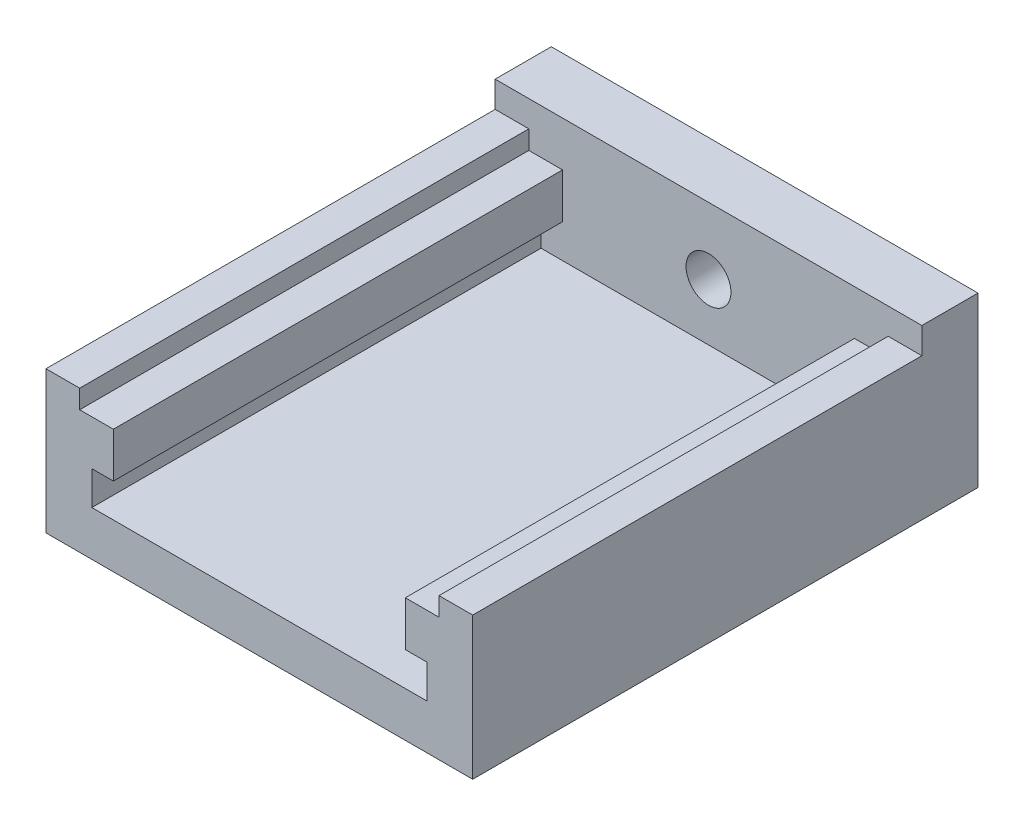
ISO-10303-21;
HEADER;
FILE_DESCRIPTION(('STEP AP214'),'2;1');
FILE_NAME('part.step','',(''),(''),'','','');
FILE_SCHEMA(('AUTOMOTIVE_DESIGN { 1 0 10303 214 1 1 1 1 }'));
ENDSEC;
DATA;
#1=APPLICATION_CONTEXT('core data for automotive mechanical design processes');
#2=APPLICATION_PROTOCOL_DEFINITION('international standard','automotive_design',2000,#1);
#3=PRODUCT_CONTEXT('',#1,'mechanical');
#4=PRODUCT('Part','Part','',(#3));
#5=PRODUCT_RELATED_PRODUCT_CATEGORY('part','',(#4));
#6=PRODUCT_DEFINITION_FORMATION('','',#4);
#7=PRODUCT_DEFINITION_CONTEXT('part definition',#1,'design');
#8=PRODUCT_DEFINITION('design','',#6,#7);
#9=PRODUCT_DEFINITION_SHAPE('','',#8);
#10=(LENGTH_UNIT() NAMED_UNIT(*) SI_UNIT(.MILLI.,.METRE.));
#11=(NAMED_UNIT(*) PLANE_ANGLE_UNIT() SI_UNIT($,.RADIAN.));
#12=(NAMED_UNIT(*) SI_UNIT($,.STERADIAN.) SOLID_ANGLE_UNIT());
#13=UNCERTAINTY_MEASURE_WITH_UNIT(LENGTH_MEASURE(1.E-05),#10,'distance_accuracy_value','');
#14=(GEOMETRIC_REPRESENTATION_CONTEXT(3) GLOBAL_UNCERTAINTY_ASSIGNED_CONTEXT((#13)) GLOBAL_UNIT_ASSIGNED_CONTEXT((#10,
#11,#12)) REPRESENTATION_CONTEXT('',''));
#15=CARTESIAN_POINT('',(0.,0.,0.));
#16=DIRECTION('',(0.,0.,1.));
#17=DIRECTION('',(1.,0.,0.));
#18=AXIS2_PLACEMENT_3D('',#15,#16,#17);
#19=CARTESIAN_POINT('',(-16.,3.60917959288161,40.));
#20=DIRECTION('',(-1.,0.,0.));
#21=DIRECTION('',(0.,0.,1.));
#22=AXIS2_PLACEMENT_3D('',#19,#20,#21);
#23=PLANE('',#22);
#24=DIRECTION('',(0.,1.,0.));
#25=VECTOR('',#24,1.);
#26=CARTESIAN_POINT('',(-16.,3.60917959288161,0.));
#27=LINE('',#26,#25);
#28=CARTESIAN_POINT('',(-16.,1.94251292621495,0.));
#29=VERTEX_POINT('',#28);
#30=CARTESIAN_POINT('',(-16.,3.60917959288161,0.));
#31=VERTEX_POINT('',#30);
#32=EDGE_CURVE('E200',#29,#31,#27,.T.);
#33=ORIENTED_EDGE('',*,*,#32,.T.);
#34=DIRECTION('',(0.,0.,-1.));
#35=VECTOR('',#34,1.);
#36=CARTESIAN_POINT('',(-16.,3.60917959288161,40.));
#37=LINE('',#36,#35);
#38=CARTESIAN_POINT('',(-16.,3.60917959288161,40.));
#39=VERTEX_POINT('',#38);
#40=EDGE_CURVE('E11',#39,#31,#37,.T.);
#41=ORIENTED_EDGE('',*,*,#40,.F.);
#42=DIRECTION('',(0.,1.,0.));
#43=VECTOR('',#42,1.);
#44=CARTESIAN_POINT('',(-16.,3.60917959288161,40.));
#45=LINE('',#44,#43);
#46=CARTESIAN_POINT('',(-16.,1.94251292621495,40.));
#47=VERTEX_POINT('',#46);
#48=EDGE_CURVE('E201',#47,#39,#45,.T.);
#49=ORIENTED_EDGE('',*,*,#48,.F.);
#50=DIRECTION('',(0.,0.,-1.));
#51=VECTOR('',#50,1.);
#52=CARTESIAN_POINT('',(-16.,1.94251292621495,40.));
#53=LINE('',#52,#51);
#54=EDGE_CURVE('E232',#47,#29,#53,.T.);
#55=ORIENTED_EDGE('',*,*,#54,.T.);
#56=EDGE_LOOP('',(#33,#41,#49,#55));
#57=FACE_BOUND('',#56,.T.);
#58=ADVANCED_FACE('F33',(#57),#23,.F.);
#59=CARTESIAN_POINT('',(-19.,3.60917959288161,40.));
#60=DIRECTION('',(0.,-1.,0.));
#61=DIRECTION('',(1.,0.,0.));
#62=AXIS2_PLACEMENT_3D('',#59,#60,#61);
#63=PLANE('',#62);
#64=DIRECTION('',(-1.,0.,0.));
#65=VECTOR('',#64,1.);
#66=CARTESIAN_POINT('',(-19.,3.60917959288161,0.));
#67=LINE('',#66,#65);
#68=CARTESIAN_POINT('',(-19.,3.60917959288161,0.));
#69=VERTEX_POINT('',#68);
#70=EDGE_CURVE('E235',#31,#69,#67,.T.);
#71=ORIENTED_EDGE('',*,*,#70,.T.);
#72=DIRECTION('',(0.,0.,-1.));
#73=VECTOR('',#72,1.);
#74=CARTESIAN_POINT('',(-19.,3.60917959288161,40.));
#75=LINE('',#74,#73);
#76=CARTESIAN_POINT('',(-19.,3.60917959288161,40.));
#77=VERTEX_POINT('',#76);
#78=EDGE_CURVE('E41',#77,#69,#75,.T.);
#79=ORIENTED_EDGE('',*,*,#78,.F.);
#80=DIRECTION('',(-1.,0.,0.));
#81=VECTOR('',#80,1.);
#82=CARTESIAN_POINT('',(-19.,3.60917959288161,40.));
#83=LINE('',#82,#81);
#84=EDGE_CURVE('E203',#39,#77,#83,.T.);
#85=ORIENTED_EDGE('',*,*,#84,.F.);
#86=ORIENTED_EDGE('',*,*,#40,.T.);
#87=EDGE_LOOP('',(#71,#79,#85,#86));
#88=FACE_BOUND('',#87,.T.);
#89=ADVANCED_FACE('F312',(#88),#63,.F.);
#90=CARTESIAN_POINT('',(-19.,-9.05748707378505,40.));
#91=DIRECTION('',(1.,0.,0.));
#92=DIRECTION('',(0.,1.,0.));
#93=AXIS2_PLACEMENT_3D('',#90,#91,#92);
#94=PLANE('',#93);
#95=ORIENTED_EDGE('',*,*,#78,.T.);
#96=DIRECTION('',(0.,1.,0.));
#97=VECTOR('',#96,1.);
#98=CARTESIAN_POINT('',(-19.,-9.05748707378505,0.));
#99=LINE('',#98,#97);
#100=CARTESIAN_POINT('',(-19.,5.94251292621495,0.));
#101=VERTEX_POINT('',#100);
#102=EDGE_CURVE('E182',#69,#101,#99,.T.);
#103=ORIENTED_EDGE('',*,*,#102,.T.);
#104=DIRECTION('',(0.,0.,1.));
#105=VECTOR('',#104,1.);
#106=CARTESIAN_POINT('',(-19.,5.94251292621495,-5.));
#107=LINE('',#106,#105);
#108=CARTESIAN_POINT('',(-19.,5.94251292621495,-5.));
#109=VERTEX_POINT('',#108);
#110=EDGE_CURVE('E197',#109,#101,#107,.T.);
#111=ORIENTED_EDGE('',*,*,#110,.F.);
#112=DIRECTION('',(0.,1.,0.));
#113=VECTOR('',#112,1.);
#114=CARTESIAN_POINT('',(-19.,-9.05748707378505,-5.));
#115=LINE('',#114,#113);
#116=CARTESIAN_POINT('',(-19.,-9.05748707378505,-5.));
#117=VERTEX_POINT('',#116);
#118=EDGE_CURVE('E173',#117,#109,#115,.T.);
#119=ORIENTED_EDGE('',*,*,#118,.F.);
#120=DIRECTION('',(0.,0.,-1.));
#121=VECTOR('',#120,1.);
#122=CARTESIAN_POINT('',(-19.,-9.05748707378505,40.));
#123=LINE('',#122,#121);
#124=CARTESIAN_POINT('',(-19.,-9.05748707378505,40.));
#125=VERTEX_POINT('',#124);
#126=EDGE_CURVE('E164',#125,#117,#123,.T.);
#127=ORIENTED_EDGE('',*,*,#126,.F.);
#128=DIRECTION('',(0.,-1.,0.));
#129=VECTOR('',#128,1.);
#130=CARTESIAN_POINT('',(-19.,-9.05748707378505,40.));
#131=LINE('',#130,#129);
#132=EDGE_CURVE('E206',#77,#125,#131,.T.);
#133=ORIENTED_EDGE('',*,*,#132,.F.);
#134=EDGE_LOOP('',(#95,#103,#111,#119,#127,#133));
#135=FACE_BOUND('',#134,.T.);
#136=ADVANCED_FACE('F308',(#135),#94,.F.);
#137=CARTESIAN_POINT('',(19.,-9.05748707378505,40.));
#138=DIRECTION('',(0.,1.,0.));
#139=DIRECTION('',(0.,0.,1.));
#140=AXIS2_PLACEMENT_3D('',#137,#138,#139);
#141=PLANE('',#140);
#142=ORIENTED_EDGE('',*,*,#126,.T.);
#143=DIRECTION('',(-1.,0.,0.));
#144=VECTOR('',#143,1.);
#145=CARTESIAN_POINT('',(19.,-9.05748707378505,-5.));
#146=LINE('',#145,#144);
#147=CARTESIAN_POINT('',(19.,-9.05748707378505,-5.));
#148=VERTEX_POINT('',#147);
#149=EDGE_CURVE('E168',#148,#117,#146,.T.);
#150=ORIENTED_EDGE('',*,*,#149,.F.);
#151=DIRECTION('',(0.,0.,-1.));
#152=VECTOR('',#151,1.);
#153=CARTESIAN_POINT('',(19.,-9.05748707378505,40.));
#154=LINE('',#153,#152);
#155=CARTESIAN_POINT('',(19.,-9.05748707378505,40.));
#156=VERTEX_POINT('',#155);
#157=EDGE_CURVE('E154',#156,#148,#154,.T.);
#158=ORIENTED_EDGE('',*,*,#157,.F.);
#159=DIRECTION('',(1.,0.,0.));
#160=VECTOR('',#159,1.);
#161=CARTESIAN_POINT('',(19.,-9.05748707378505,40.));
#162=LINE('',#161,#160);
#163=EDGE_CURVE('E208',#125,#156,#162,.T.);
#164=ORIENTED_EDGE('',*,*,#163,.F.);
#165=EDGE_LOOP('',(#142,#150,#158,#164));
#166=FACE_BOUND('',#165,.T.);
#167=ADVANCED_FACE('F169',(#166),#141,.F.);
#168=CARTESIAN_POINT('',(19.,-9.05748707378505,40.));
#169=DIRECTION('',(-1.,0.,0.));
#170=DIRECTION('',(0.,-1.,0.));
#171=AXIS2_PLACEMENT_3D('',#168,#169,#170);
#172=PLANE('',#171);
#173=ORIENTED_EDGE('',*,*,#157,.T.);
#174=DIRECTION('',(0.,-1.,0.));
#175=VECTOR('',#174,1.);
#176=CARTESIAN_POINT('',(19.,-9.05748707378505,-5.));
#177=LINE('',#176,#175);
#178=CARTESIAN_POINT('',(19.,5.94251292621495,-5.));
#179=VERTEX_POINT('',#178);
#180=EDGE_CURVE('E159',#179,#148,#177,.T.);
#181=ORIENTED_EDGE('',*,*,#180,.F.);
#182=DIRECTION('',(0.,0.,1.));
#183=VECTOR('',#182,1.);
#184=CARTESIAN_POINT('',(19.,5.94251292621495,-5.));
#185=LINE('',#184,#183);
#186=CARTESIAN_POINT('',(19.,5.94251292621495,0.));
#187=VERTEX_POINT('',#186);
#188=EDGE_CURVE('E190',#179,#187,#185,.T.);
#189=ORIENTED_EDGE('',*,*,#188,.T.);
#190=DIRECTION('',(0.,-1.,0.));
#191=VECTOR('',#190,1.);
#192=CARTESIAN_POINT('',(19.,-9.05748707378505,0.));
#193=LINE('',#192,#191);
#194=CARTESIAN_POINT('',(19.,3.60917959288161,0.));
#195=VERTEX_POINT('',#194);
#196=EDGE_CURVE('E191',#187,#195,#193,.T.);
#197=ORIENTED_EDGE('',*,*,#196,.T.);
#198=DIRECTION('',(0.,0.,-1.));
#199=VECTOR('',#198,1.);
#200=CARTESIAN_POINT('',(19.,3.60917959288161,40.));
#201=LINE('',#200,#199);
#202=CARTESIAN_POINT('',(19.,3.60917959288161,40.));
#203=VERTEX_POINT('',#202);
#204=EDGE_CURVE('E165',#203,#195,#201,.T.);
#205=ORIENTED_EDGE('',*,*,#204,.F.);
#206=DIRECTION('',(0.,1.,0.));
#207=VECTOR('',#206,1.);
#208=CARTESIAN_POINT('',(19.,-9.05748707378505,40.));
#209=LINE('',#208,#207);
#210=EDGE_CURVE('E161',#156,#203,#209,.T.);
#211=ORIENTED_EDGE('',*,*,#210,.F.);
#212=EDGE_LOOP('',(#173,#181,#189,#197,#205,#211));
#213=FACE_BOUND('',#212,.T.);
#214=ADVANCED_FACE('F156',(#213),#172,.F.);
#215=CARTESIAN_POINT('',(19.,3.60917959288161,40.));
#216=DIRECTION('',(0.,-1.,0.));
#217=DIRECTION('',(1.,0.,0.));
#218=AXIS2_PLACEMENT_3D('',#215,#216,#217);
#219=PLANE('',#218);
#220=DIRECTION('',(-1.,0.,0.));
#221=VECTOR('',#220,1.);
#222=CARTESIAN_POINT('',(19.,3.60917959288161,0.));
#223=LINE('',#222,#221);
#224=CARTESIAN_POINT('',(16.,3.60917959288161,0.));
#225=VERTEX_POINT('',#224);
#226=EDGE_CURVE('E238',#195,#225,#223,.T.);
#227=ORIENTED_EDGE('',*,*,#226,.T.);
#228=DIRECTION('',(0.,0.,-1.));
#229=VECTOR('',#228,1.);
#230=CARTESIAN_POINT('',(16.,3.60917959288161,40.));
#231=LINE('',#230,#229);
#232=CARTESIAN_POINT('',(16.,3.60917959288161,40.));
#233=VERTEX_POINT('',#232);
#234=EDGE_CURVE('E299',#233,#225,#231,.T.);
#235=ORIENTED_EDGE('',*,*,#234,.F.);
#236=DIRECTION('',(-1.,0.,0.));
#237=VECTOR('',#236,1.);
#238=CARTESIAN_POINT('',(19.,3.60917959288161,40.));
#239=LINE('',#238,#237);
#240=EDGE_CURVE('E211',#203,#233,#239,.T.);
#241=ORIENTED_EDGE('',*,*,#240,.F.);
#242=ORIENTED_EDGE('',*,*,#204,.T.);
#243=EDGE_LOOP('',(#227,#235,#241,#242));
#244=FACE_BOUND('',#243,.T.);
#245=ADVANCED_FACE('F322',(#244),#219,.F.);
#246=CARTESIAN_POINT('',(16.,3.60917959288161,40.));
#247=DIRECTION('',(1.,0.,0.));
#248=DIRECTION('',(0.,0.,-1.));
#249=AXIS2_PLACEMENT_3D('',#246,#247,#248);
#250=PLANE('',#249);
#251=DIRECTION('',(0.,-1.,0.));
#252=VECTOR('',#251,1.);
#253=CARTESIAN_POINT('',(16.,3.60917959288161,0.));
#254=LINE('',#253,#252);
#255=CARTESIAN_POINT('',(16.,1.94251292621495,0.));
#256=VERTEX_POINT('',#255);
#257=EDGE_CURVE('E241',#225,#256,#254,.T.);
#258=ORIENTED_EDGE('',*,*,#257,.T.);
#259=DIRECTION('',(0.,0.,-1.));
#260=VECTOR('',#259,1.);
#261=CARTESIAN_POINT('',(16.,1.94251292621495,40.));
#262=LINE('',#261,#260);
#263=CARTESIAN_POINT('',(16.,1.94251292621495,40.));
#264=VERTEX_POINT('',#263);
#265=EDGE_CURVE('E296',#264,#256,#262,.T.);
#266=ORIENTED_EDGE('',*,*,#265,.F.);
#267=DIRECTION('',(0.,-1.,0.));
#268=VECTOR('',#267,1.);
#269=CARTESIAN_POINT('',(16.,3.60917959288161,40.));
#270=LINE('',#269,#268);
#271=EDGE_CURVE('E213',#233,#264,#270,.T.);
#272=ORIENTED_EDGE('',*,*,#271,.F.);
#273=ORIENTED_EDGE('',*,*,#234,.T.);
#274=EDGE_LOOP('',(#258,#266,#272,#273));
#275=FACE_BOUND('',#274,.T.);
#276=ADVANCED_FACE('F364',(#275),#250,.F.);
#277=CARTESIAN_POINT('',(16.,1.94251292621495,40.));
#278=DIRECTION('',(0.,-1.,0.));
#279=DIRECTION('',(0.,0.,-1.));
#280=AXIS2_PLACEMENT_3D('',#277,#278,#279);
#281=PLANE('',#280);
#282=DIRECTION('',(-1.,0.,0.));
#283=VECTOR('',#282,1.);
#284=CARTESIAN_POINT('',(16.,1.94251292621495,0.));
#285=LINE('',#284,#283);
#286=CARTESIAN_POINT('',(13.,1.94251292621495,0.));
#287=VERTEX_POINT('',#286);
#288=EDGE_CURVE('E244',#256,#287,#285,.T.);
#289=ORIENTED_EDGE('',*,*,#288,.T.);
#290=DIRECTION('',(0.,0.,-1.));
#291=VECTOR('',#290,1.);
#292=CARTESIAN_POINT('',(13.,1.94251292621495,40.));
#293=LINE('',#292,#291);
#294=CARTESIAN_POINT('',(13.,1.94251292621495,40.));
#295=VERTEX_POINT('',#294);
#296=EDGE_CURVE('E293',#295,#287,#293,.T.);
#297=ORIENTED_EDGE('',*,*,#296,.F.);
#298=DIRECTION('',(-1.,0.,0.));
#299=VECTOR('',#298,1.);
#300=CARTESIAN_POINT('',(16.,1.94251292621495,40.));
#301=LINE('',#300,#299);
#302=EDGE_CURVE('E215',#264,#295,#301,.T.);
#303=ORIENTED_EDGE('',*,*,#302,.F.);
#304=ORIENTED_EDGE('',*,*,#265,.T.);
#305=EDGE_LOOP('',(#289,#297,#303,#304));
#306=FACE_BOUND('',#305,.T.);
#307=ADVANCED_FACE('F362',(#306),#281,.F.);
#308=CARTESIAN_POINT('',(13.,1.94251292621495,40.));
#309=DIRECTION('',(1.,0.,0.));
#310=DIRECTION('',(0.,0.,-1.));
#311=AXIS2_PLACEMENT_3D('',#308,#309,#310);
#312=PLANE('',#311);
#313=DIRECTION('',(0.,-1.,0.));
#314=VECTOR('',#313,1.);
#315=CARTESIAN_POINT('',(13.,1.94251292621495,0.));
#316=LINE('',#315,#314);
#317=CARTESIAN_POINT('',(13.,-2.05748707378505,0.));
#318=VERTEX_POINT('',#317);
#319=EDGE_CURVE('E247',#287,#318,#316,.T.);
#320=ORIENTED_EDGE('',*,*,#319,.T.);
#321=DIRECTION('',(0.,0.,-1.));
#322=VECTOR('',#321,1.);
#323=CARTESIAN_POINT('',(13.,-2.05748707378505,40.));
#324=LINE('',#323,#322);
#325=CARTESIAN_POINT('',(13.,-2.05748707378505,40.));
#326=VERTEX_POINT('',#325);
#327=EDGE_CURVE('E290',#326,#318,#324,.T.);
#328=ORIENTED_EDGE('',*,*,#327,.F.);
#329=DIRECTION('',(0.,-1.,0.));
#330=VECTOR('',#329,1.);
#331=CARTESIAN_POINT('',(13.,1.94251292621495,40.));
#332=LINE('',#331,#330);
#333=EDGE_CURVE('E217',#295,#326,#332,.T.);
#334=ORIENTED_EDGE('',*,*,#333,.F.);
#335=ORIENTED_EDGE('',*,*,#296,.T.);
#336=EDGE_LOOP('',(#320,#328,#334,#335));
#337=FACE_BOUND('',#336,.T.);
#338=ADVANCED_FACE('F357',(#337),#312,.F.);
#339=CARTESIAN_POINT('',(13.,-2.05748707378505,40.));
#340=DIRECTION('',(0.,1.,0.));
#341=DIRECTION('',(-1.,0.,0.));
#342=AXIS2_PLACEMENT_3D('',#339,#340,#341);
#343=PLANE('',#342);
#344=DIRECTION('',(1.,0.,0.));
#345=VECTOR('',#344,1.);
#346=CARTESIAN_POINT('',(13.,-2.05748707378505,0.));
#347=LINE('',#346,#345);
#348=CARTESIAN_POINT('',(14.9166666666667,-2.05748707378505,0.));
#349=VERTEX_POINT('',#348);
#350=EDGE_CURVE('E250',#318,#349,#347,.T.);
#351=ORIENTED_EDGE('',*,*,#350,.T.);
#352=DIRECTION('',(0.,0.,-1.));
#353=VECTOR('',#352,1.);
#354=CARTESIAN_POINT('',(14.9166666666667,-2.05748707378505,40.));
#355=LINE('',#354,#353);
#356=CARTESIAN_POINT('',(14.9166666666667,-2.05748707378505,40.));
#357=VERTEX_POINT('',#356);
#358=EDGE_CURVE('E287',#357,#349,#355,.T.);
#359=ORIENTED_EDGE('',*,*,#358,.F.);
#360=DIRECTION('',(1.,0.,0.));
#361=VECTOR('',#360,1.);
#362=CARTESIAN_POINT('',(13.,-2.05748707378505,40.));
#363=LINE('',#362,#361);
#364=EDGE_CURVE('E219',#326,#357,#363,.T.);
#365=ORIENTED_EDGE('',*,*,#364,.F.);
#366=ORIENTED_EDGE('',*,*,#327,.T.);
#367=EDGE_LOOP('',(#351,#359,#365,#366));
#368=FACE_BOUND('',#367,.T.);
#369=ADVANCED_FACE('F354',(#368),#343,.F.);
#370=CARTESIAN_POINT('',(14.9166666666667,-2.05748707378505,40.));
#371=DIRECTION('',(1.,0.,0.));
#372=DIRECTION('',(0.,1.,0.));
#373=AXIS2_PLACEMENT_3D('',#370,#371,#372);
#374=PLANE('',#373);
#375=DIRECTION('',(0.,-1.,0.));
#376=VECTOR('',#375,1.);
#377=CARTESIAN_POINT('',(14.9166666666667,-2.05748707378505,0.));
#378=LINE('',#377,#376);
#379=CARTESIAN_POINT('',(14.9166666666667,-5.05748707378505,0.));
#380=VERTEX_POINT('',#379);
#381=EDGE_CURVE('E253',#349,#380,#378,.T.);
#382=ORIENTED_EDGE('',*,*,#381,.T.);
#383=DIRECTION('',(0.,0.,-1.));
#384=VECTOR('',#383,1.);
#385=CARTESIAN_POINT('',(14.9166666666667,-5.05748707378505,40.));
#386=LINE('',#385,#384);
#387=CARTESIAN_POINT('',(14.9166666666667,-5.05748707378505,40.));
#388=VERTEX_POINT('',#387);
#389=EDGE_CURVE('E284',#388,#380,#386,.T.);
#390=ORIENTED_EDGE('',*,*,#389,.F.);
#391=DIRECTION('',(0.,-1.,0.));
#392=VECTOR('',#391,1.);
#393=CARTESIAN_POINT('',(14.9166666666667,-2.05748707378505,40.));
#394=LINE('',#393,#392);
#395=EDGE_CURVE('E221',#357,#388,#394,.T.);
#396=ORIENTED_EDGE('',*,*,#395,.F.);
#397=ORIENTED_EDGE('',*,*,#358,.T.);
#398=EDGE_LOOP('',(#382,#390,#396,#397));
#399=FACE_BOUND('',#398,.T.);
#400=ADVANCED_FACE('F349',(#399),#374,.F.);
#401=CARTESIAN_POINT('',(-14.9166666666667,-5.05748707378505,40.));
#402=DIRECTION('',(0.,-1.,0.));
#403=DIRECTION('',(0.,0.,-1.));
#404=AXIS2_PLACEMENT_3D('',#401,#402,#403);
#405=PLANE('',#404);
#406=DIRECTION('',(-1.,0.,0.));
#407=VECTOR('',#406,1.);
#408=CARTESIAN_POINT('',(-14.9166666666667,-5.05748707378505,0.));
#409=LINE('',#408,#407);
#410=CARTESIAN_POINT('',(-14.9166666666667,-5.05748707378505,0.));
#411=VERTEX_POINT('',#410);
#412=EDGE_CURVE('E256',#380,#411,#409,.T.);
#413=ORIENTED_EDGE('',*,*,#412,.T.);
#414=DIRECTION('',(0.,0.,-1.));
#415=VECTOR('',#414,1.);
#416=CARTESIAN_POINT('',(-14.9166666666667,-5.05748707378505,40.));
#417=LINE('',#416,#415);
#418=CARTESIAN_POINT('',(-14.9166666666667,-5.05748707378505,40.));
#419=VERTEX_POINT('',#418);
#420=EDGE_CURVE('E281',#419,#411,#417,.T.);
#421=ORIENTED_EDGE('',*,*,#420,.F.);
#422=DIRECTION('',(-1.,0.,0.));
#423=VECTOR('',#422,1.);
#424=CARTESIAN_POINT('',(-14.9166666666667,-5.05748707378505,40.));
#425=LINE('',#424,#423);
#426=EDGE_CURVE('E223',#388,#419,#425,.T.);
#427=ORIENTED_EDGE('',*,*,#426,.F.);
#428=ORIENTED_EDGE('',*,*,#389,.T.);
#429=EDGE_LOOP('',(#413,#421,#427,#428));
#430=FACE_BOUND('',#429,.T.);
#431=ADVANCED_FACE('F346',(#430),#405,.F.);
#432=CARTESIAN_POINT('',(-14.9166666666667,-2.05748707378505,40.));
#433=DIRECTION('',(-1.,0.,0.));
#434=DIRECTION('',(0.,-1.,0.));
#435=AXIS2_PLACEMENT_3D('',#432,#433,#434);
#436=PLANE('',#435);
#437=DIRECTION('',(0.,1.,0.));
#438=VECTOR('',#437,1.);
#439=CARTESIAN_POINT('',(-14.9166666666667,-2.05748707378505,0.));
#440=LINE('',#439,#438);
#441=CARTESIAN_POINT('',(-14.9166666666667,-2.05748707378505,0.));
#442=VERTEX_POINT('',#441);
#443=EDGE_CURVE('E259',#411,#442,#440,.T.);
#444=ORIENTED_EDGE('',*,*,#443,.T.);
#445=DIRECTION('',(0.,0.,-1.));
#446=VECTOR('',#445,1.);
#447=CARTESIAN_POINT('',(-14.9166666666667,-2.05748707378505,40.));
#448=LINE('',#447,#446);
#449=CARTESIAN_POINT('',(-14.9166666666667,-2.05748707378505,40.));
#450=VERTEX_POINT('',#449);
#451=EDGE_CURVE('E278',#450,#442,#448,.T.);
#452=ORIENTED_EDGE('',*,*,#451,.F.);
#453=DIRECTION('',(0.,1.,0.));
#454=VECTOR('',#453,1.);
#455=CARTESIAN_POINT('',(-14.9166666666667,-2.05748707378505,40.));
#456=LINE('',#455,#454);
#457=EDGE_CURVE('E225',#419,#450,#456,.T.);
#458=ORIENTED_EDGE('',*,*,#457,.F.);
#459=ORIENTED_EDGE('',*,*,#420,.T.);
#460=EDGE_LOOP('',(#444,#452,#458,#459));
#461=FACE_BOUND('',#460,.T.);
#462=ADVANCED_FACE('F341',(#461),#436,.F.);
#463=CARTESIAN_POINT('',(-13.,-2.05748707378505,40.));
#464=DIRECTION('',(0.,1.,0.));
#465=DIRECTION('',(-1.,0.,0.));
#466=AXIS2_PLACEMENT_3D('',#463,#464,#465);
#467=PLANE('',#466);
#468=DIRECTION('',(1.,0.,0.));
#469=VECTOR('',#468,1.);
#470=CARTESIAN_POINT('',(-13.,-2.05748707378505,0.));
#471=LINE('',#470,#469);
#472=CARTESIAN_POINT('',(-13.,-2.05748707378505,0.));
#473=VERTEX_POINT('',#472);
#474=EDGE_CURVE('E262',#442,#473,#471,.T.);
#475=ORIENTED_EDGE('',*,*,#474,.T.);
#476=DIRECTION('',(0.,0.,-1.));
#477=VECTOR('',#476,1.);
#478=CARTESIAN_POINT('',(-13.,-2.05748707378505,40.));
#479=LINE('',#478,#477);
#480=CARTESIAN_POINT('',(-13.,-2.05748707378505,40.));
#481=VERTEX_POINT('',#480);
#482=EDGE_CURVE('E275',#481,#473,#479,.T.);
#483=ORIENTED_EDGE('',*,*,#482,.F.);
#484=DIRECTION('',(1.,0.,0.));
#485=VECTOR('',#484,1.);
#486=CARTESIAN_POINT('',(-13.,-2.05748707378505,40.));
#487=LINE('',#486,#485);
#488=EDGE_CURVE('E227',#450,#481,#487,.T.);
#489=ORIENTED_EDGE('',*,*,#488,.F.);
#490=ORIENTED_EDGE('',*,*,#451,.T.);
#491=EDGE_LOOP('',(#475,#483,#489,#490));
#492=FACE_BOUND('',#491,.T.);
#493=ADVANCED_FACE('F338',(#492),#467,.F.);
#494=CARTESIAN_POINT('',(-13.,1.94251292621495,40.));
#495=DIRECTION('',(-1.,0.,0.));
#496=DIRECTION('',(0.,-1.,0.));
#497=AXIS2_PLACEMENT_3D('',#494,#495,#496);
#498=PLANE('',#497);
#499=DIRECTION('',(0.,1.,0.));
#500=VECTOR('',#499,1.);
#501=CARTESIAN_POINT('',(-13.,1.94251292621495,0.));
#502=LINE('',#501,#500);
#503=CARTESIAN_POINT('',(-13.,1.94251292621495,0.));
#504=VERTEX_POINT('',#503);
#505=EDGE_CURVE('E265',#473,#504,#502,.T.);
#506=ORIENTED_EDGE('',*,*,#505,.T.);
#507=DIRECTION('',(0.,0.,-1.));
#508=VECTOR('',#507,1.);
#509=CARTESIAN_POINT('',(-13.,1.94251292621495,40.));
#510=LINE('',#509,#508);
#511=CARTESIAN_POINT('',(-13.,1.94251292621495,40.));
#512=VERTEX_POINT('',#511);
#513=EDGE_CURVE('E272',#512,#504,#510,.T.);
#514=ORIENTED_EDGE('',*,*,#513,.F.);
#515=DIRECTION('',(0.,1.,0.));
#516=VECTOR('',#515,1.);
#517=CARTESIAN_POINT('',(-13.,1.94251292621495,40.));
#518=LINE('',#517,#516);
#519=EDGE_CURVE('E229',#481,#512,#518,.T.);
#520=ORIENTED_EDGE('',*,*,#519,.F.);
#521=ORIENTED_EDGE('',*,*,#482,.T.);
#522=EDGE_LOOP('',(#506,#514,#520,#521));
#523=FACE_BOUND('',#522,.T.);
#524=ADVANCED_FACE('F333',(#523),#498,.F.);
#525=CARTESIAN_POINT('',(-16.,1.94251292621495,40.));
#526=DIRECTION('',(0.,-1.,0.));
#527=DIRECTION('',(0.,0.,-1.));
#528=AXIS2_PLACEMENT_3D('',#525,#526,#527);
#529=PLANE('',#528);
#530=DIRECTION('',(-1.,0.,0.));
#531=VECTOR('',#530,1.);
#532=CARTESIAN_POINT('',(-16.,1.94251292621495,0.));
#533=LINE('',#532,#531);
#534=EDGE_CURVE('E204',#504,#29,#533,.T.);
#535=ORIENTED_EDGE('',*,*,#534,.T.);
#536=ORIENTED_EDGE('',*,*,#54,.F.);
#537=DIRECTION('',(-1.,0.,0.));
#538=VECTOR('',#537,1.);
#539=CARTESIAN_POINT('',(-16.,1.94251292621495,40.));
#540=LINE('',#539,#538);
#541=EDGE_CURVE('E48',#512,#47,#540,.T.);
#542=ORIENTED_EDGE('',*,*,#541,.F.);
#543=ORIENTED_EDGE('',*,*,#513,.T.);
#544=EDGE_LOOP('',(#535,#536,#542,#543));
#545=FACE_BOUND('',#544,.T.);
#546=ADVANCED_FACE('F330',(#545),#529,.F.);
#547=CARTESIAN_POINT('',(0.,0.,40.));
#548=DIRECTION('',(0.,0.,1.));
#549=DIRECTION('',(1.,0.,0.));
#550=AXIS2_PLACEMENT_3D('',#547,#548,#549);
#551=PLANE('',#550);
#552=ORIENTED_EDGE('',*,*,#48,.T.);
#553=ORIENTED_EDGE('',*,*,#84,.T.);
#554=ORIENTED_EDGE('',*,*,#132,.T.);
#555=ORIENTED_EDGE('',*,*,#163,.T.);
#556=ORIENTED_EDGE('',*,*,#210,.T.);
#557=ORIENTED_EDGE('',*,*,#240,.T.);
#558=ORIENTED_EDGE('',*,*,#271,.T.);
#559=ORIENTED_EDGE('',*,*,#302,.T.);
#560=ORIENTED_EDGE('',*,*,#333,.T.);
#561=ORIENTED_EDGE('',*,*,#364,.T.);
#562=ORIENTED_EDGE('',*,*,#395,.T.);
#563=ORIENTED_EDGE('',*,*,#426,.T.);
#564=ORIENTED_EDGE('',*,*,#457,.T.);
#565=ORIENTED_EDGE('',*,*,#488,.T.);
#566=ORIENTED_EDGE('',*,*,#519,.T.);
#567=ORIENTED_EDGE('',*,*,#541,.T.);
#568=EDGE_LOOP('',(#552,#553,#554,#555,#556,#557,#558,#559,#560,#561,#562,#563,#564,#565,#566,#567));
#569=FACE_BOUND('',#568,.T.);
#570=ADVANCED_FACE('F325',(#569),#551,.T.);
#571=CARTESIAN_POINT('',(0.,0.,0.));
#572=DIRECTION('',(0.,0.,1.));
#573=DIRECTION('',(1.,0.,0.));
#574=AXIS2_PLACEMENT_3D('',#571,#572,#573);
#575=PLANE('',#574);
#576=CARTESIAN_POINT('',(0.,0.,0.));
#577=DIRECTION('',(0.,0.,-1.));
#578=DIRECTION('',(-1.,0.,0.));
#579=AXIS2_PLACEMENT_3D('',#576,#577,#578);
#580=CIRCLE('',#579,2.);
#581=CARTESIAN_POINT('',(-2.,0.,0.));
#582=VERTEX_POINT('',#581);
#583=EDGE_CURVE('E185',#582,#582,#580,.T.);
#584=ORIENTED_EDGE('',*,*,#583,.T.);
#585=EDGE_LOOP('',(#584));
#586=FACE_BOUND('',#585,.T.);
#587=ORIENTED_EDGE('',*,*,#226,.F.);
#588=ORIENTED_EDGE('',*,*,#196,.F.);
#589=DIRECTION('',(1.,0.,0.));
#590=VECTOR('',#589,1.);
#591=CARTESIAN_POINT('',(19.,5.94251292621495,0.));
#592=LINE('',#591,#590);
#593=EDGE_CURVE('E180',#101,#187,#592,.T.);
#594=ORIENTED_EDGE('',*,*,#593,.F.);
#595=ORIENTED_EDGE('',*,*,#102,.F.);
#596=ORIENTED_EDGE('',*,*,#70,.F.);
#597=ORIENTED_EDGE('',*,*,#32,.F.);
#598=ORIENTED_EDGE('',*,*,#534,.F.);
#599=ORIENTED_EDGE('',*,*,#505,.F.);
#600=ORIENTED_EDGE('',*,*,#474,.F.);
#601=ORIENTED_EDGE('',*,*,#443,.F.);
#602=ORIENTED_EDGE('',*,*,#412,.F.);
#603=ORIENTED_EDGE('',*,*,#381,.F.);
#604=ORIENTED_EDGE('',*,*,#350,.F.);
#605=ORIENTED_EDGE('',*,*,#319,.F.);
#606=ORIENTED_EDGE('',*,*,#288,.F.);
#607=ORIENTED_EDGE('',*,*,#257,.F.);
#608=EDGE_LOOP('',(#587,#588,#594,#595,#596,#597,#598,#599,#600,#601,#602,#603,#604,#605,#606,#607));
#609=FACE_BOUND('',#608,.T.);
#610=ADVANCED_FACE('F315',(#586,#609),#575,.T.);
#611=CARTESIAN_POINT('',(0.,0.,-5.));
#612=DIRECTION('',(0.,0.,1.));
#613=DIRECTION('',(1.,0.,0.));
#614=AXIS2_PLACEMENT_3D('',#611,#612,#613);
#615=PLANE('',#614);
#616=ORIENTED_EDGE('',*,*,#180,.T.);
#617=ORIENTED_EDGE('',*,*,#149,.T.);
#618=ORIENTED_EDGE('',*,*,#118,.T.);
#619=DIRECTION('',(1.,0.,0.));
#620=VECTOR('',#619,1.);
#621=CARTESIAN_POINT('',(19.,5.94251292621495,-5.));
#622=LINE('',#621,#620);
#623=EDGE_CURVE('E178',#109,#179,#622,.T.);
#624=ORIENTED_EDGE('',*,*,#623,.T.);
#625=EDGE_LOOP('',(#616,#617,#618,#624));
#626=FACE_BOUND('',#625,.T.);
#627=CARTESIAN_POINT('',(0.,0.,-5.));
#628=DIRECTION('',(0.,0.,-1.));
#629=DIRECTION('',(-1.,0.,0.));
#630=AXIS2_PLACEMENT_3D('',#627,#628,#629);
#631=CIRCLE('',#630,2.);
#632=CARTESIAN_POINT('',(-2.,0.,-5.));
#633=VERTEX_POINT('',#632);
#634=EDGE_CURVE('E194',#633,#633,#631,.T.);
#635=ORIENTED_EDGE('',*,*,#634,.F.);
#636=EDGE_LOOP('',(#635));
#637=FACE_BOUND('',#636,.T.);
#638=ADVANCED_FACE('F175',(#626,#637),#615,.F.);
#639=CARTESIAN_POINT('',(19.,5.94251292621495,-5.));
#640=DIRECTION('',(0.,-1.,0.));
#641=DIRECTION('',(0.,0.,-1.));
#642=AXIS2_PLACEMENT_3D('',#639,#640,#641);
#643=PLANE('',#642);
#644=ORIENTED_EDGE('',*,*,#593,.T.);
#645=ORIENTED_EDGE('',*,*,#188,.F.);
#646=ORIENTED_EDGE('',*,*,#623,.F.);
#647=ORIENTED_EDGE('',*,*,#110,.T.);
#648=EDGE_LOOP('',(#644,#645,#646,#647));
#649=FACE_BOUND('',#648,.T.);
#650=ADVANCED_FACE('F319',(#649),#643,.F.);
#651=CARTESIAN_POINT('',(0.,0.,-5.));
#652=DIRECTION('',(0.,0.,1.));
#653=DIRECTION('',(1.,0.,0.));
#654=AXIS2_PLACEMENT_3D('',#651,#652,#653);
#655=CYLINDRICAL_SURFACE('',#654,2.);
#656=ORIENTED_EDGE('',*,*,#634,.T.);
#657=EDGE_LOOP('',(#656));
#658=FACE_BOUND('',#657,.T.);
#659=ORIENTED_EDGE('',*,*,#583,.F.);
#660=EDGE_LOOP('',(#659));
#661=FACE_BOUND('',#660,.T.);
#662=ADVANCED_FACE('F496',(#658,#661),#655,.F.);
#663=CLOSED_SHELL('',(#58,#89,#136,#167,#214,#245,#276,#307,#338,#369,#400,#431,#462,#493,#524,
#546,#570,#610,#638,#650,#662));
#664=MANIFOLD_SOLID_BREP('B2',#663);
#665=ADVANCED_BREP_SHAPE_REPRESENTATION('',(#18,#664),#14);
#666=SHAPE_DEFINITION_REPRESENTATION(#9,#665);
ENDSEC;
END-ISO-10303-21;
